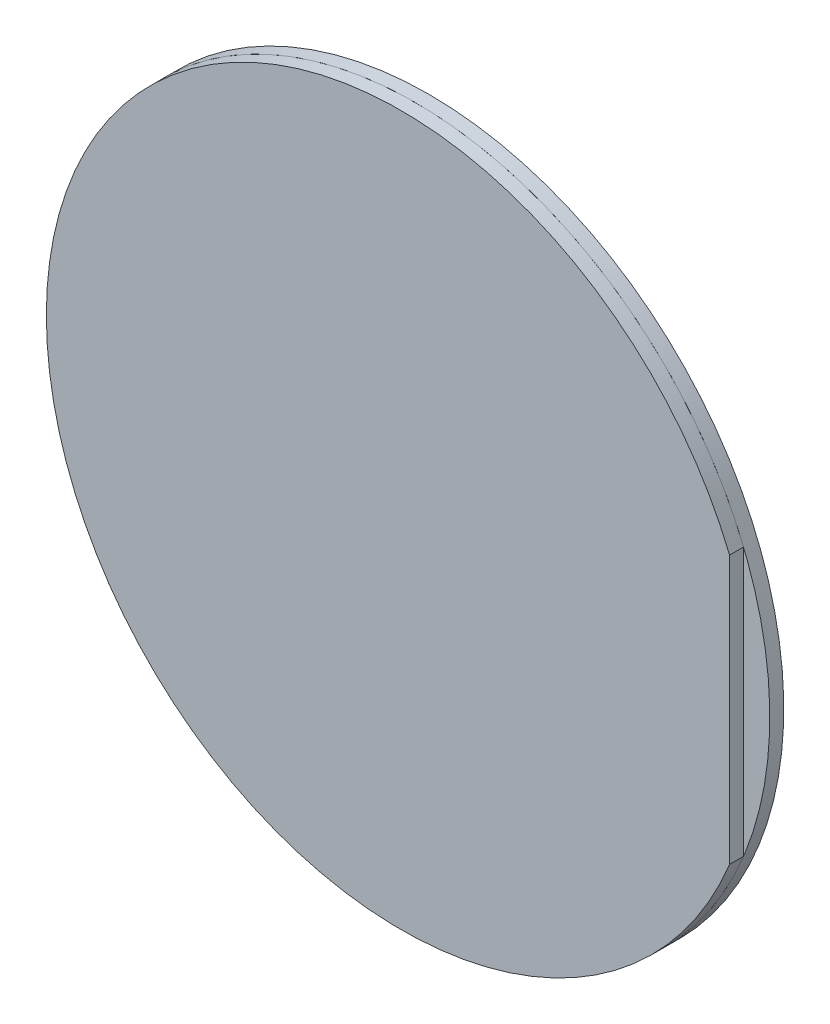
ISO-10303-21;
HEADER;
FILE_DESCRIPTION(('STEP AP214'),'2;1');
FILE_NAME('part.step','',(''),(''),'','','');
FILE_SCHEMA(('AUTOMOTIVE_DESIGN { 1 0 10303 214 1 1 1 1 }'));
ENDSEC;
DATA;
#1=APPLICATION_CONTEXT('core data for automotive mechanical design processes');
#2=APPLICATION_PROTOCOL_DEFINITION('international standard','automotive_design',2000,#1);
#3=PRODUCT_CONTEXT('',#1,'mechanical');
#4=PRODUCT('Part','Part','',(#3));
#5=PRODUCT_RELATED_PRODUCT_CATEGORY('part','',(#4));
#6=PRODUCT_DEFINITION_FORMATION('','',#4);
#7=PRODUCT_DEFINITION_CONTEXT('part definition',#1,'design');
#8=PRODUCT_DEFINITION('design','',#6,#7);
#9=PRODUCT_DEFINITION_SHAPE('','',#8);
#10=(LENGTH_UNIT() NAMED_UNIT(*) SI_UNIT(.MILLI.,.METRE.));
#11=(NAMED_UNIT(*) PLANE_ANGLE_UNIT() SI_UNIT($,.RADIAN.));
#12=(NAMED_UNIT(*) SI_UNIT($,.STERADIAN.) SOLID_ANGLE_UNIT());
#13=UNCERTAINTY_MEASURE_WITH_UNIT(LENGTH_MEASURE(1.E-05),#10,'distance_accuracy_value','');
#14=(GEOMETRIC_REPRESENTATION_CONTEXT(3) GLOBAL_UNCERTAINTY_ASSIGNED_CONTEXT((#13)) GLOBAL_UNIT_ASSIGNED_CONTEXT((#10,
#11,#12)) REPRESENTATION_CONTEXT('',''));
#15=CARTESIAN_POINT('',(0.,0.,0.));
#16=DIRECTION('',(0.,0.,1.));
#17=DIRECTION('',(1.,0.,0.));
#18=AXIS2_PLACEMENT_3D('',#15,#16,#17);
#19=CARTESIAN_POINT('',(12.1795756508242,-0.829902614356014,4.48618474318159));
#20=DIRECTION('',(0.,0.,-1.));
#21=DIRECTION('',(0.,-1.,0.));
#22=AXIS2_PLACEMENT_3D('',#19,#20,#21);
#23=CYLINDRICAL_SURFACE('',#22,12.7);
#24=CARTESIAN_POINT('',(12.1795756508242,-0.829902614356014,4.48618474318159));
#25=DIRECTION('',(0.,0.,1.));
#26=DIRECTION('',(0.,1.,0.));
#27=AXIS2_PLACEMENT_3D('',#24,#25,#26);
#28=CIRCLE('',#27,12.7);
#29=CARTESIAN_POINT('',(23.9395756508242,3.96513648871708,4.48618474318159));
#30=VERTEX_POINT('',#29);
#31=CARTESIAN_POINT('',(23.9395756508242,-5.62494171742911,4.48618474318159));
#32=VERTEX_POINT('',#31);
#33=EDGE_CURVE('P0_E23',#30,#32,#28,.T.);
#34=ORIENTED_EDGE('',*,*,#33,.F.);
#35=DIRECTION('',(0.,0.,-1.));
#36=VECTOR('',#35,1.);
#37=CARTESIAN_POINT('',(23.9395756508242,3.96513648871708,4.48618474318159));
#38=LINE('',#37,#36);
#39=CARTESIAN_POINT('',(23.9395756508242,3.96513648871708,3.98618474318159));
#40=VERTEX_POINT('',#39);
#41=EDGE_CURVE('P0_E37',#30,#40,#38,.T.);
#42=ORIENTED_EDGE('',*,*,#41,.T.);
#43=CARTESIAN_POINT('',(12.1795756508242,-0.829902614356014,3.98618474318159));
#44=DIRECTION('',(0.,0.,1.));
#45=DIRECTION('',(0.,1.,0.));
#46=AXIS2_PLACEMENT_3D('',#43,#44,#45);
#47=CIRCLE('',#46,12.7);
#48=CARTESIAN_POINT('',(23.9395756508242,-5.62494171742911,3.98618474318159));
#49=VERTEX_POINT('',#48);
#50=EDGE_CURVE('P0_E45',#40,#49,#47,.T.);
#51=ORIENTED_EDGE('',*,*,#50,.T.);
#52=DIRECTION('',(0.,0.,-1.));
#53=VECTOR('',#52,1.);
#54=CARTESIAN_POINT('',(23.9395756508242,-5.62494171742911,4.48618474318159));
#55=LINE('',#54,#53);
#56=EDGE_CURVE('P0_E30',#49,#32,#55,.F.);
#57=ORIENTED_EDGE('',*,*,#56,.T.);
#58=EDGE_LOOP('',(#34,#42,#51,#57));
#59=FACE_BOUND('',#58,.T.);
#60=ADVANCED_FACE('P0_F16',(#59),#23,.T.);
#61=CARTESIAN_POINT('',(12.1795756508242,-0.829902614356014,4.48618474318159));
#62=DIRECTION('',(0.,0.,1.));
#63=DIRECTION('',(0.,1.,0.));
#64=AXIS2_PLACEMENT_3D('',#61,#62,#63);
#65=PLANE('',#64);
#66=DIRECTION('',(0.,-1.,0.));
#67=VECTOR('',#66,1.);
#68=CARTESIAN_POINT('',(23.9395756508242,-6.71724068804703,4.48618474318159));
#69=LINE('',#68,#67);
#70=EDGE_CURVE('P0_E40',#30,#32,#69,.T.);
#71=ORIENTED_EDGE('',*,*,#70,.F.);
#72=ORIENTED_EDGE('',*,*,#33,.T.);
#73=EDGE_LOOP('',(#71,#72));
#74=FACE_BOUND('',#73,.T.);
#75=ADVANCED_FACE('P0_F49',(#74),#65,.T.);
#76=CARTESIAN_POINT('',(12.1795756508242,-0.829902614356014,3.98618474318159));
#77=DIRECTION('',(0.,0.,1.));
#78=DIRECTION('',(0.,1.,0.));
#79=AXIS2_PLACEMENT_3D('',#76,#77,#78);
#80=PLANE('',#79);
#81=ORIENTED_EDGE('',*,*,#50,.F.);
#82=DIRECTION('',(0.,-1.,0.));
#83=VECTOR('',#82,1.);
#84=CARTESIAN_POINT('',(23.9395756508242,-0.829902614356016,3.98618474318159));
#85=LINE('',#84,#83);
#86=EDGE_CURVE('P0_E10',#40,#49,#85,.T.);
#87=ORIENTED_EDGE('',*,*,#86,.T.);
#88=EDGE_LOOP('',(#81,#87));
#89=FACE_BOUND('',#88,.T.);
#90=ADVANCED_FACE('P0_F54',(#89),#80,.F.);
#91=CARTESIAN_POINT('',(23.9395756508242,-6.71724068804703,3.98618474318159));
#92=DIRECTION('',(-1.,0.,0.));
#93=DIRECTION('',(0.,0.,1.));
#94=AXIS2_PLACEMENT_3D('',#91,#92,#93);
#95=PLANE('',#94);
#96=ORIENTED_EDGE('',*,*,#70,.T.);
#97=ORIENTED_EDGE('',*,*,#56,.F.);
#98=ORIENTED_EDGE('',*,*,#86,.F.);
#99=ORIENTED_EDGE('',*,*,#41,.F.);
#100=EDGE_LOOP('',(#96,#97,#98,#99));
#101=FACE_BOUND('',#100,.T.);
#102=ADVANCED_FACE('P0_F39',(#101),#95,.F.);
#103=CLOSED_SHELL('',(#60,#75,#90,#102));
#104=MANIFOLD_SOLID_BREP('P0_B1',#103);
#105=CARTESIAN_POINT('',(12.1795756508242,-0.829902614356014,3.98618474318159));
#106=DIRECTION('',(0.,0.,-1.));
#107=DIRECTION('',(-1.,0.,0.));
#108=AXIS2_PLACEMENT_3D('',#105,#106,#107);
#109=CYLINDRICAL_SURFACE('',#108,12.7);
#110=CARTESIAN_POINT('',(12.1795756508242,-0.829902614356014,3.98618474318159));
#111=DIRECTION('',(0.,0.,1.));
#112=DIRECTION('',(1.,0.,0.));
#113=AXIS2_PLACEMENT_3D('',#110,#111,#112);
#114=CIRCLE('',#113,12.7);
#115=CARTESIAN_POINT('',(16.9746147538973,-12.589902614356,3.98618474318159));
#116=VERTEX_POINT('',#115);
#117=CARTESIAN_POINT('',(7.38453654775109,-12.589902614356,3.98618474318159));
#118=VERTEX_POINT('',#117);
#119=EDGE_CURVE('P1_E24',#116,#118,#114,.T.);
#120=ORIENTED_EDGE('',*,*,#119,.F.);
#121=DIRECTION('',(0.,0.,-1.));
#122=VECTOR('',#121,1.);
#123=CARTESIAN_POINT('',(16.9746147538973,-12.589902614356,3.98618474318159));
#124=LINE('',#123,#122);
#125=CARTESIAN_POINT('',(16.9746147538973,-12.589902614356,3.48618474318159));
#126=VERTEX_POINT('',#125);
#127=EDGE_CURVE('P1_E38',#116,#126,#124,.T.);
#128=ORIENTED_EDGE('',*,*,#127,.T.);
#129=CARTESIAN_POINT('',(12.1795756508242,-0.829902614356014,3.48618474318159));
#130=DIRECTION('',(0.,0.,1.));
#131=DIRECTION('',(1.,0.,0.));
#132=AXIS2_PLACEMENT_3D('',#129,#130,#131);
#133=CIRCLE('',#132,12.7);
#134=CARTESIAN_POINT('',(7.38453654775109,-12.589902614356,3.48618474318159));
#135=VERTEX_POINT('',#134);
#136=EDGE_CURVE('P1_E46',#126,#135,#133,.T.);
#137=ORIENTED_EDGE('',*,*,#136,.T.);
#138=DIRECTION('',(0.,0.,-1.));
#139=VECTOR('',#138,1.);
#140=CARTESIAN_POINT('',(7.38453654775109,-12.589902614356,3.98618474318159));
#141=LINE('',#140,#139);
#142=EDGE_CURVE('P1_E31',#135,#118,#141,.F.);
#143=ORIENTED_EDGE('',*,*,#142,.T.);
#144=EDGE_LOOP('',(#120,#128,#137,#143));
#145=FACE_BOUND('',#144,.T.);
#146=ADVANCED_FACE('P1_F17',(#145),#109,.T.);
#147=CARTESIAN_POINT('',(12.1795756508242,-0.829902614356014,3.98618474318159));
#148=DIRECTION('',(0.,0.,1.));
#149=DIRECTION('',(1.,0.,0.));
#150=AXIS2_PLACEMENT_3D('',#147,#148,#149);
#151=PLANE('',#150);
#152=DIRECTION('',(-1.,0.,0.));
#153=VECTOR('',#152,1.);
#154=CARTESIAN_POINT('',(6.29223757713317,-12.589902614356,3.98618474318159));
#155=LINE('',#154,#153);
#156=EDGE_CURVE('P1_E41',#116,#118,#155,.T.);
#157=ORIENTED_EDGE('',*,*,#156,.F.);
#158=ORIENTED_EDGE('',*,*,#119,.T.);
#159=EDGE_LOOP('',(#157,#158));
#160=FACE_BOUND('',#159,.T.);
#161=ADVANCED_FACE('P1_F50',(#160),#151,.T.);
#162=CARTESIAN_POINT('',(12.1795756508242,-0.829902614356014,3.48618474318159));
#163=DIRECTION('',(0.,0.,1.));
#164=DIRECTION('',(1.,0.,0.));
#165=AXIS2_PLACEMENT_3D('',#162,#163,#164);
#166=PLANE('',#165);
#167=ORIENTED_EDGE('',*,*,#136,.F.);
#168=DIRECTION('',(-1.,0.,0.));
#169=VECTOR('',#168,1.);
#170=CARTESIAN_POINT('',(12.1795756508242,-12.589902614356,3.48618474318159));
#171=LINE('',#170,#169);
#172=EDGE_CURVE('P1_E11',#126,#135,#171,.T.);
#173=ORIENTED_EDGE('',*,*,#172,.T.);
#174=EDGE_LOOP('',(#167,#173));
#175=FACE_BOUND('',#174,.T.);
#176=ADVANCED_FACE('P1_F55',(#175),#166,.F.);
#177=CARTESIAN_POINT('',(6.29223757713317,-12.589902614356,3.48618474318159));
#178=DIRECTION('',(0.,1.,0.));
#179=DIRECTION('',(0.,0.,1.));
#180=AXIS2_PLACEMENT_3D('',#177,#178,#179);
#181=PLANE('',#180);
#182=ORIENTED_EDGE('',*,*,#156,.T.);
#183=ORIENTED_EDGE('',*,*,#142,.F.);
#184=ORIENTED_EDGE('',*,*,#172,.F.);
#185=ORIENTED_EDGE('',*,*,#127,.F.);
#186=EDGE_LOOP('',(#182,#183,#184,#185));
#187=FACE_BOUND('',#186,.T.);
#188=ADVANCED_FACE('P1_F40',(#187),#181,.F.);
#189=CLOSED_SHELL('',(#146,#161,#176,#188));
#190=MANIFOLD_SOLID_BREP('P1_B1',#189);
#191=ADVANCED_BREP_SHAPE_REPRESENTATION('',(#18,#104,#190),#14);
#192=SHAPE_DEFINITION_REPRESENTATION(#9,#191);
ENDSEC;
END-ISO-10303-21;
